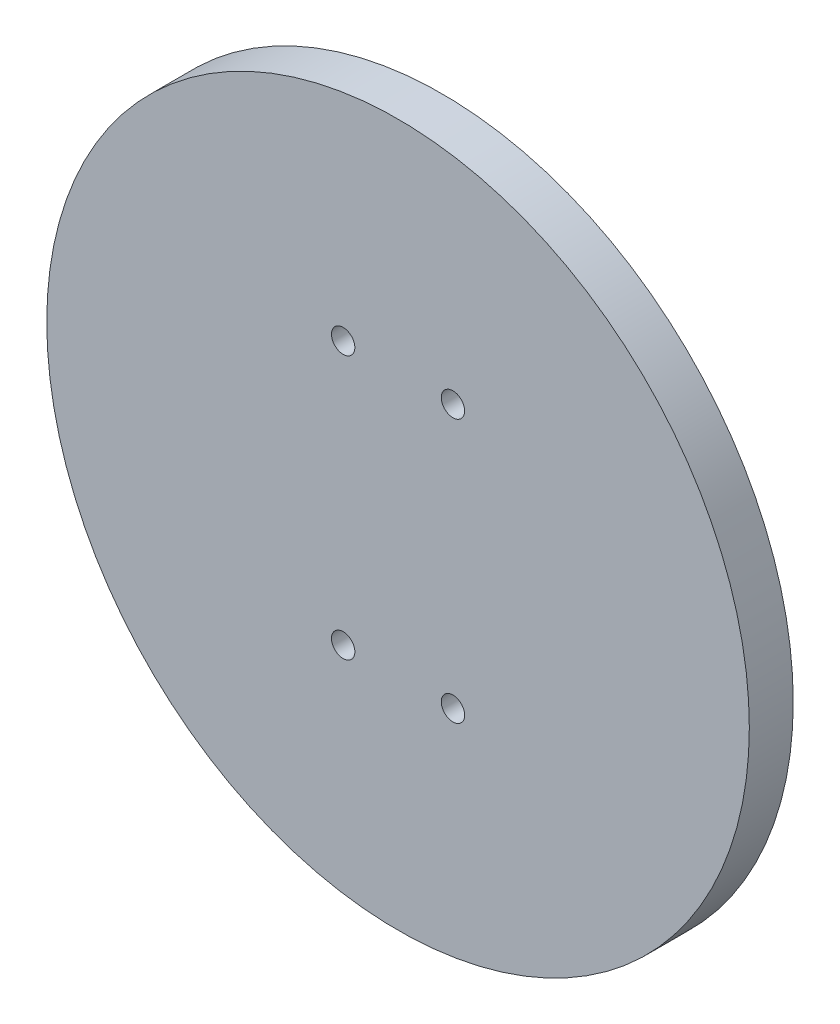
ISO-10303-21;
HEADER;
FILE_DESCRIPTION(('STEP AP214'),'2;1');
FILE_NAME('part.step','',(''),(''),'','','');
FILE_SCHEMA(('AUTOMOTIVE_DESIGN { 1 0 10303 214 1 1 1 1 }'));
ENDSEC;
DATA;
#1=APPLICATION_CONTEXT('core data for automotive mechanical design processes');
#2=APPLICATION_PROTOCOL_DEFINITION('international standard','automotive_design',2000,#1);
#3=PRODUCT_CONTEXT('',#1,'mechanical');
#4=PRODUCT('Part','Part','',(#3));
#5=PRODUCT_RELATED_PRODUCT_CATEGORY('part','',(#4));
#6=PRODUCT_DEFINITION_FORMATION('','',#4);
#7=PRODUCT_DEFINITION_CONTEXT('part definition',#1,'design');
#8=PRODUCT_DEFINITION('design','',#6,#7);
#9=PRODUCT_DEFINITION_SHAPE('','',#8);
#10=(LENGTH_UNIT() NAMED_UNIT(*) SI_UNIT(.MILLI.,.METRE.));
#11=(NAMED_UNIT(*) PLANE_ANGLE_UNIT() SI_UNIT($,.RADIAN.));
#12=(NAMED_UNIT(*) SI_UNIT($,.STERADIAN.) SOLID_ANGLE_UNIT());
#13=UNCERTAINTY_MEASURE_WITH_UNIT(LENGTH_MEASURE(1.E-05),#10,'distance_accuracy_value','');
#14=(GEOMETRIC_REPRESENTATION_CONTEXT(3) GLOBAL_UNCERTAINTY_ASSIGNED_CONTEXT((#13)) GLOBAL_UNIT_ASSIGNED_CONTEXT((#10,
#11,#12)) REPRESENTATION_CONTEXT('',''));
#15=CARTESIAN_POINT('',(0.,0.,0.));
#16=DIRECTION('',(0.,0.,1.));
#17=DIRECTION('',(1.,0.,0.));
#18=AXIS2_PLACEMENT_3D('',#15,#16,#17);
#19=CARTESIAN_POINT('',(0.,0.,12.7));
#20=DIRECTION('',(0.,0.,-1.));
#21=DIRECTION('',(-1.,0.,0.));
#22=AXIS2_PLACEMENT_3D('',#19,#20,#21);
#23=CYLINDRICAL_SURFACE('',#22,101.6);
#24=CARTESIAN_POINT('',(0.,0.,12.7));
#25=DIRECTION('',(0.,0.,1.));
#26=DIRECTION('',(1.,0.,0.));
#27=AXIS2_PLACEMENT_3D('',#24,#25,#26);
#28=CIRCLE('',#27,101.6);
#29=CARTESIAN_POINT('',(101.6,0.,12.7));
#30=VERTEX_POINT('',#29);
#31=EDGE_CURVE('E12',#30,#30,#28,.T.);
#32=ORIENTED_EDGE('',*,*,#31,.F.);
#33=EDGE_LOOP('',(#32));
#34=FACE_BOUND('',#33,.T.);
#35=CARTESIAN_POINT('',(0.,0.,0.));
#36=DIRECTION('',(0.,0.,1.));
#37=DIRECTION('',(1.,0.,0.));
#38=AXIS2_PLACEMENT_3D('',#35,#36,#37);
#39=CIRCLE('',#38,101.6);
#40=CARTESIAN_POINT('',(101.6,0.,0.));
#41=VERTEX_POINT('',#40);
#42=EDGE_CURVE('E53',#41,#41,#39,.T.);
#43=ORIENTED_EDGE('',*,*,#42,.T.);
#44=EDGE_LOOP('',(#43));
#45=FACE_BOUND('',#44,.T.);
#46=ADVANCED_FACE('F46',(#34,#45),#23,.T.);
#47=CARTESIAN_POINT('',(0.,0.,12.7));
#48=DIRECTION('',(0.,0.,1.));
#49=DIRECTION('',(1.,0.,0.));
#50=AXIS2_PLACEMENT_3D('',#47,#48,#49);
#51=PLANE('',#50);
#52=CARTESIAN_POINT('',(15.875,-38.1,12.7));
#53=DIRECTION('',(0.,0.,1.));
#54=DIRECTION('',(1.,0.,0.));
#55=AXIS2_PLACEMENT_3D('',#52,#53,#54);
#56=CIRCLE('',#55,3.3782);
#57=CARTESIAN_POINT('',(19.2532,-38.1,12.7));
#58=VERTEX_POINT('',#57);
#59=EDGE_CURVE('E49',#58,#58,#56,.T.);
#60=ORIENTED_EDGE('',*,*,#59,.F.);
#61=EDGE_LOOP('',(#60));
#62=FACE_BOUND('',#61,.T.);
#63=CARTESIAN_POINT('',(15.875,38.1,12.7));
#64=DIRECTION('',(0.,0.,1.));
#65=DIRECTION('',(1.,0.,0.));
#66=AXIS2_PLACEMENT_3D('',#63,#64,#65);
#67=CIRCLE('',#66,3.3782);
#68=CARTESIAN_POINT('',(19.2532,38.1,12.7));
#69=VERTEX_POINT('',#68);
#70=EDGE_CURVE('E70',#69,#69,#67,.T.);
#71=ORIENTED_EDGE('',*,*,#70,.F.);
#72=EDGE_LOOP('',(#71));
#73=FACE_BOUND('',#72,.T.);
#74=CARTESIAN_POINT('',(-15.875,38.1,12.7));
#75=DIRECTION('',(0.,0.,1.));
#76=DIRECTION('',(1.,0.,0.));
#77=AXIS2_PLACEMENT_3D('',#74,#75,#76);
#78=CIRCLE('',#77,3.3782);
#79=CARTESIAN_POINT('',(-12.4968,38.1,12.7));
#80=VERTEX_POINT('',#79);
#81=EDGE_CURVE('E66',#80,#80,#78,.T.);
#82=ORIENTED_EDGE('',*,*,#81,.F.);
#83=EDGE_LOOP('',(#82));
#84=FACE_BOUND('',#83,.T.);
#85=CARTESIAN_POINT('',(-15.875,-38.1,12.7));
#86=DIRECTION('',(0.,0.,1.));
#87=DIRECTION('',(1.,0.,0.));
#88=AXIS2_PLACEMENT_3D('',#85,#86,#87);
#89=CIRCLE('',#88,3.3782);
#90=CARTESIAN_POINT('',(-12.4968,-38.1,12.7));
#91=VERTEX_POINT('',#90);
#92=EDGE_CURVE('E58',#91,#91,#89,.T.);
#93=ORIENTED_EDGE('',*,*,#92,.F.);
#94=EDGE_LOOP('',(#93));
#95=FACE_BOUND('',#94,.T.);
#96=ORIENTED_EDGE('',*,*,#31,.T.);
#97=EDGE_LOOP('',(#96));
#98=FACE_BOUND('',#97,.T.);
#99=ADVANCED_FACE('F111',(#62,#73,#84,#95,#98),#51,.T.);
#100=CARTESIAN_POINT('',(0.,0.,0.));
#101=DIRECTION('',(0.,0.,1.));
#102=DIRECTION('',(1.,0.,0.));
#103=AXIS2_PLACEMENT_3D('',#100,#101,#102);
#104=PLANE('',#103);
#105=CARTESIAN_POINT('',(15.875,-38.1,0.));
#106=DIRECTION('',(0.,0.,-1.));
#107=DIRECTION('',(-1.,0.,0.));
#108=AXIS2_PLACEMENT_3D('',#105,#106,#107);
#109=CIRCLE('',#108,6.4389);
#110=CARTESIAN_POINT('',(9.4361,-38.1,0.));
#111=VERTEX_POINT('',#110);
#112=EDGE_CURVE('E130',#111,#111,#109,.T.);
#113=ORIENTED_EDGE('',*,*,#112,.F.);
#114=EDGE_LOOP('',(#113));
#115=FACE_BOUND('',#114,.T.);
#116=CARTESIAN_POINT('',(15.875,38.1,0.));
#117=DIRECTION('',(0.,0.,-1.));
#118=DIRECTION('',(-1.,0.,0.));
#119=AXIS2_PLACEMENT_3D('',#116,#117,#118);
#120=CIRCLE('',#119,6.4389);
#121=CARTESIAN_POINT('',(9.4361,38.1,0.));
#122=VERTEX_POINT('',#121);
#123=EDGE_CURVE('E79',#122,#122,#120,.T.);
#124=ORIENTED_EDGE('',*,*,#123,.F.);
#125=EDGE_LOOP('',(#124));
#126=FACE_BOUND('',#125,.T.);
#127=CARTESIAN_POINT('',(-15.875,38.1,0.));
#128=DIRECTION('',(0.,0.,-1.));
#129=DIRECTION('',(-1.,0.,0.));
#130=AXIS2_PLACEMENT_3D('',#127,#128,#129);
#131=CIRCLE('',#130,6.4389);
#132=CARTESIAN_POINT('',(-22.3139,38.1,0.));
#133=VERTEX_POINT('',#132);
#134=EDGE_CURVE('E72',#133,#133,#131,.T.);
#135=ORIENTED_EDGE('',*,*,#134,.F.);
#136=EDGE_LOOP('',(#135));
#137=FACE_BOUND('',#136,.T.);
#138=CARTESIAN_POINT('',(-15.875,-38.1,0.));
#139=DIRECTION('',(0.,0.,-1.));
#140=DIRECTION('',(-1.,0.,0.));
#141=AXIS2_PLACEMENT_3D('',#138,#139,#140);
#142=CIRCLE('',#141,6.4389);
#143=CARTESIAN_POINT('',(-22.3139,-38.1,0.));
#144=VERTEX_POINT('',#143);
#145=EDGE_CURVE('E68',#144,#144,#142,.T.);
#146=ORIENTED_EDGE('',*,*,#145,.F.);
#147=EDGE_LOOP('',(#146));
#148=FACE_BOUND('',#147,.T.);
#149=ORIENTED_EDGE('',*,*,#42,.F.);
#150=EDGE_LOOP('',(#149));
#151=FACE_BOUND('',#150,.T.);
#152=ADVANCED_FACE('F107',(#115,#126,#137,#148,#151),#104,.F.);
#153=CARTESIAN_POINT('',(-15.875,-38.1,0.));
#154=DIRECTION('',(0.,0.,-1.));
#155=DIRECTION('',(-1.,0.,0.));
#156=AXIS2_PLACEMENT_3D('',#153,#154,#155);
#157=CYLINDRICAL_SURFACE('',#156,3.3782);
#158=ORIENTED_EDGE('',*,*,#92,.T.);
#159=EDGE_LOOP('',(#158));
#160=FACE_BOUND('',#159,.T.);
#161=CARTESIAN_POINT('',(-15.875,-38.1,2.5682322411443));
#162=DIRECTION('',(0.,0.,-1.));
#163=DIRECTION('',(-1.,0.,0.));
#164=AXIS2_PLACEMENT_3D('',#161,#162,#163);
#165=CIRCLE('',#164,3.3782);
#166=CARTESIAN_POINT('',(-19.2532,-38.1,2.5682322411443));
#167=VERTEX_POINT('',#166);
#168=EDGE_CURVE('E61',#167,#167,#165,.T.);
#169=ORIENTED_EDGE('',*,*,#168,.T.);
#170=EDGE_LOOP('',(#169));
#171=FACE_BOUND('',#170,.T.);
#172=ADVANCED_FACE('F94',(#160,#171),#157,.F.);
#173=CARTESIAN_POINT('',(-15.875,-38.1,0.));
#174=DIRECTION('',(0.,0.,-1.));
#175=DIRECTION('',(-1.,0.,0.));
#176=AXIS2_PLACEMENT_3D('',#173,#174,#175);
#177=CONICAL_SURFACE('',#176,6.4389,0.872664625997165);
#178=ORIENTED_EDGE('',*,*,#168,.F.);
#179=EDGE_LOOP('',(#178));
#180=FACE_BOUND('',#179,.T.);
#181=ORIENTED_EDGE('',*,*,#145,.T.);
#182=EDGE_LOOP('',(#181));
#183=FACE_BOUND('',#182,.T.);
#184=ADVANCED_FACE('F96',(#180,#183),#177,.F.);
#185=CARTESIAN_POINT('',(-15.875,38.1,0.));
#186=DIRECTION('',(0.,0.,-1.));
#187=DIRECTION('',(-1.,0.,0.));
#188=AXIS2_PLACEMENT_3D('',#185,#186,#187);
#189=CYLINDRICAL_SURFACE('',#188,3.3782);
#190=ORIENTED_EDGE('',*,*,#81,.T.);
#191=EDGE_LOOP('',(#190));
#192=FACE_BOUND('',#191,.T.);
#193=CARTESIAN_POINT('',(-15.875,38.1,2.5682322411443));
#194=DIRECTION('',(0.,0.,-1.));
#195=DIRECTION('',(-1.,0.,0.));
#196=AXIS2_PLACEMENT_3D('',#193,#194,#195);
#197=CIRCLE('',#196,3.3782);
#198=CARTESIAN_POINT('',(-19.2532,38.1,2.5682322411443));
#199=VERTEX_POINT('',#198);
#200=EDGE_CURVE('E69',#199,#199,#197,.T.);
#201=ORIENTED_EDGE('',*,*,#200,.T.);
#202=EDGE_LOOP('',(#201));
#203=FACE_BOUND('',#202,.T.);
#204=ADVANCED_FACE('F98',(#192,#203),#189,.F.);
#205=CARTESIAN_POINT('',(-15.875,38.1,0.));
#206=DIRECTION('',(0.,0.,-1.));
#207=DIRECTION('',(-1.,0.,0.));
#208=AXIS2_PLACEMENT_3D('',#205,#206,#207);
#209=CONICAL_SURFACE('',#208,6.4389,0.872664625997165);
#210=ORIENTED_EDGE('',*,*,#200,.F.);
#211=EDGE_LOOP('',(#210));
#212=FACE_BOUND('',#211,.T.);
#213=ORIENTED_EDGE('',*,*,#134,.T.);
#214=EDGE_LOOP('',(#213));
#215=FACE_BOUND('',#214,.T.);
#216=ADVANCED_FACE('F104',(#212,#215),#209,.F.);
#217=CARTESIAN_POINT('',(15.875,38.1,0.));
#218=DIRECTION('',(0.,0.,-1.));
#219=DIRECTION('',(-1.,0.,0.));
#220=AXIS2_PLACEMENT_3D('',#217,#218,#219);
#221=CYLINDRICAL_SURFACE('',#220,3.3782);
#222=ORIENTED_EDGE('',*,*,#70,.T.);
#223=EDGE_LOOP('',(#222));
#224=FACE_BOUND('',#223,.T.);
#225=CARTESIAN_POINT('',(15.875,38.1,2.5682322411443));
#226=DIRECTION('',(0.,0.,-1.));
#227=DIRECTION('',(-1.,0.,0.));
#228=AXIS2_PLACEMENT_3D('',#225,#226,#227);
#229=CIRCLE('',#228,3.3782);
#230=CARTESIAN_POINT('',(12.4968,38.1,2.5682322411443));
#231=VERTEX_POINT('',#230);
#232=EDGE_CURVE('E73',#231,#231,#229,.T.);
#233=ORIENTED_EDGE('',*,*,#232,.T.);
#234=EDGE_LOOP('',(#233));
#235=FACE_BOUND('',#234,.T.);
#236=ADVANCED_FACE('F137',(#224,#235),#221,.F.);
#237=CARTESIAN_POINT('',(15.875,38.1,0.));
#238=DIRECTION('',(0.,0.,-1.));
#239=DIRECTION('',(-1.,0.,0.));
#240=AXIS2_PLACEMENT_3D('',#237,#238,#239);
#241=CONICAL_SURFACE('',#240,6.4389,0.872664625997165);
#242=ORIENTED_EDGE('',*,*,#232,.F.);
#243=EDGE_LOOP('',(#242));
#244=FACE_BOUND('',#243,.T.);
#245=ORIENTED_EDGE('',*,*,#123,.T.);
#246=EDGE_LOOP('',(#245));
#247=FACE_BOUND('',#246,.T.);
#248=ADVANCED_FACE('F143',(#244,#247),#241,.F.);
#249=CARTESIAN_POINT('',(15.875,-38.1,0.));
#250=DIRECTION('',(0.,0.,-1.));
#251=DIRECTION('',(-1.,0.,0.));
#252=AXIS2_PLACEMENT_3D('',#249,#250,#251);
#253=CYLINDRICAL_SURFACE('',#252,3.3782);
#254=ORIENTED_EDGE('',*,*,#59,.T.);
#255=EDGE_LOOP('',(#254));
#256=FACE_BOUND('',#255,.T.);
#257=CARTESIAN_POINT('',(15.875,-38.1,2.5682322411443));
#258=DIRECTION('',(0.,0.,-1.));
#259=DIRECTION('',(-1.,0.,0.));
#260=AXIS2_PLACEMENT_3D('',#257,#258,#259);
#261=CIRCLE('',#260,3.3782);
#262=CARTESIAN_POINT('',(12.4968,-38.1,2.5682322411443));
#263=VERTEX_POINT('',#262);
#264=EDGE_CURVE('E162',#263,#263,#261,.T.);
#265=ORIENTED_EDGE('',*,*,#264,.T.);
#266=EDGE_LOOP('',(#265));
#267=FACE_BOUND('',#266,.T.);
#268=ADVANCED_FACE('F149',(#256,#267),#253,.F.);
#269=CARTESIAN_POINT('',(15.875,-38.1,0.));
#270=DIRECTION('',(0.,0.,-1.));
#271=DIRECTION('',(-1.,0.,0.));
#272=AXIS2_PLACEMENT_3D('',#269,#270,#271);
#273=CONICAL_SURFACE('',#272,6.4389,0.872664625997165);
#274=ORIENTED_EDGE('',*,*,#264,.F.);
#275=EDGE_LOOP('',(#274));
#276=FACE_BOUND('',#275,.T.);
#277=ORIENTED_EDGE('',*,*,#112,.T.);
#278=EDGE_LOOP('',(#277));
#279=FACE_BOUND('',#278,.T.);
#280=ADVANCED_FACE('F153',(#276,#279),#273,.F.);
#281=CLOSED_SHELL('',(#46,#99,#152,#172,#184,#204,#216,#236,#248,#268,#280));
#282=MANIFOLD_SOLID_BREP('B2',#281);
#283=ADVANCED_BREP_SHAPE_REPRESENTATION('',(#18,#282),#14);
#284=SHAPE_DEFINITION_REPRESENTATION(#9,#283);
ENDSEC;
END-ISO-10303-21;
